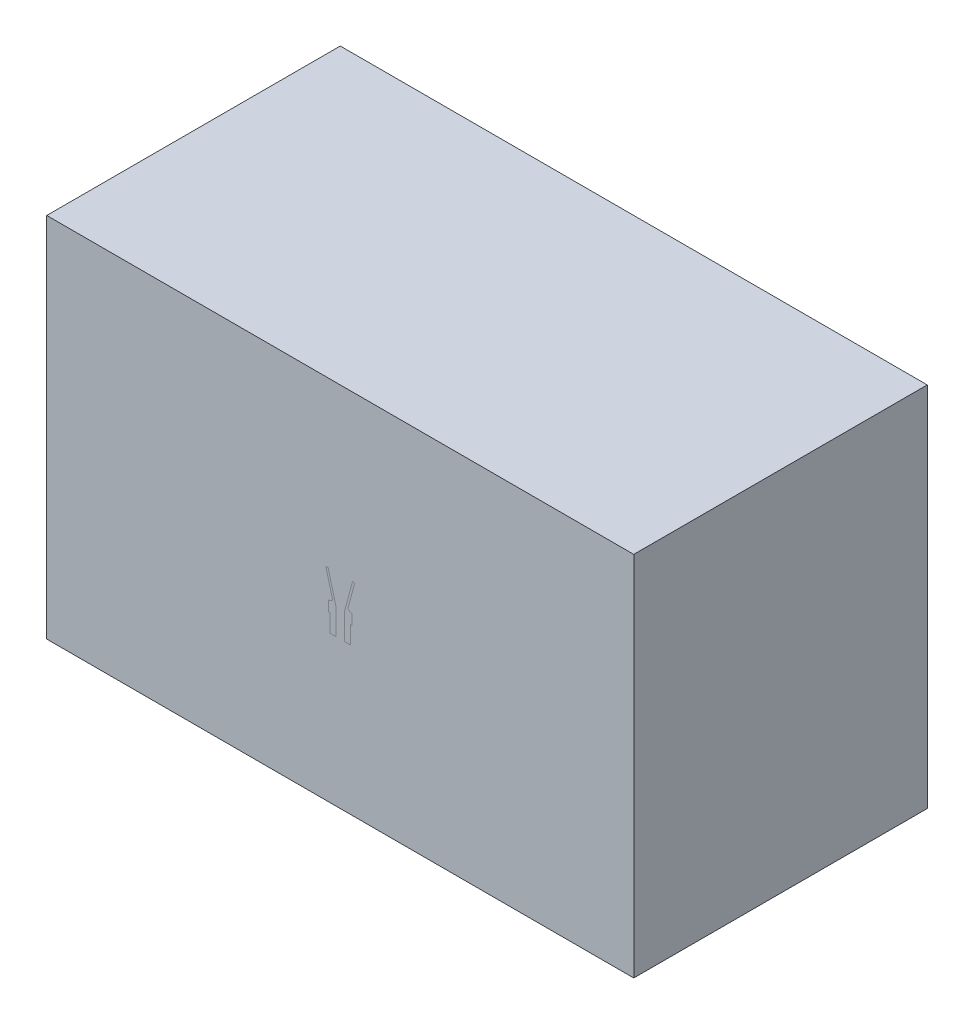
ISO-10303-21;
HEADER;
FILE_DESCRIPTION(('STEP AP214'),'2;1');
FILE_NAME('part.step','',(''),(''),'','','');
FILE_SCHEMA(('AUTOMOTIVE_DESIGN { 1 0 10303 214 1 1 1 1 }'));
ENDSEC;
DATA;
#1=APPLICATION_CONTEXT('core data for automotive mechanical design processes');
#2=APPLICATION_PROTOCOL_DEFINITION('international standard','automotive_design',2000,#1);
#3=PRODUCT_CONTEXT('',#1,'mechanical');
#4=PRODUCT('Part','Part','',(#3));
#5=PRODUCT_RELATED_PRODUCT_CATEGORY('part','',(#4));
#6=PRODUCT_DEFINITION_FORMATION('','',#4);
#7=PRODUCT_DEFINITION_CONTEXT('part definition',#1,'design');
#8=PRODUCT_DEFINITION('design','',#6,#7);
#9=PRODUCT_DEFINITION_SHAPE('','',#8);
#10=(LENGTH_UNIT() NAMED_UNIT(*) SI_UNIT(.MILLI.,.METRE.));
#11=(NAMED_UNIT(*) PLANE_ANGLE_UNIT() SI_UNIT($,.RADIAN.));
#12=(NAMED_UNIT(*) SI_UNIT($,.STERADIAN.) SOLID_ANGLE_UNIT());
#13=UNCERTAINTY_MEASURE_WITH_UNIT(LENGTH_MEASURE(1.E-05),#10,'distance_accuracy_value','');
#14=(GEOMETRIC_REPRESENTATION_CONTEXT(3) GLOBAL_UNCERTAINTY_ASSIGNED_CONTEXT((#13)) GLOBAL_UNIT_ASSIGNED_CONTEXT((#10,
#11,#12)) REPRESENTATION_CONTEXT('',''));
#15=CARTESIAN_POINT('',(0.,0.,0.));
#16=DIRECTION('',(0.,0.,1.));
#17=DIRECTION('',(1.,0.,0.));
#18=AXIS2_PLACEMENT_3D('',#15,#16,#17);
#19=CARTESIAN_POINT('',(0.,457.,0.));
#20=DIRECTION('',(0.,1.,0.));
#21=DIRECTION('',(0.,0.,1.));
#22=AXIS2_PLACEMENT_3D('',#19,#20,#21);
#23=CONICAL_SURFACE('',#22,75.,0.261799387799143);
#24=DIRECTION('',(0.258819045102515,0.96592582628907,0.));
#25=VECTOR('',#24,1.);
#26=CARTESIAN_POINT('',(0.,177.096189432327,0.));
#27=LINE('',#26,#25);
#28=CARTESIAN_POINT('',(213.054078657681,972.22483574259,0.));
#29=VERTEX_POINT('',#28);
#30=CARTESIAN_POINT('',(75.,457.,0.));
#31=VERTEX_POINT('',#30);
#32=EDGE_CURVE('E171',#29,#31,#27,.F.);
#33=ORIENTED_EDGE('',*,*,#32,.F.);
#34=CARTESIAN_POINT('',(0.,972.22483574259,0.));
#35=DIRECTION('',(0.,-1.,0.));
#36=DIRECTION('',(0.,0.,-1.));
#37=AXIS2_PLACEMENT_3D('',#34,#35,#36);
#38=CIRCLE('',#37,213.054078657681);
#39=CARTESIAN_POINT('',(-213.054078657681,972.22483574259,0.));
#40=VERTEX_POINT('',#39);
#41=EDGE_CURVE('E155',#40,#29,#38,.T.);
#42=ORIENTED_EDGE('',*,*,#41,.F.);
#43=DIRECTION('',(0.258819045102515,-0.96592582628907,0.));
#44=VECTOR('',#43,1.);
#45=CARTESIAN_POINT('',(0.,177.096189432327,0.));
#46=LINE('',#45,#44);
#47=CARTESIAN_POINT('',(-75.,457.,0.));
#48=VERTEX_POINT('',#47);
#49=EDGE_CURVE('E136',#48,#40,#46,.F.);
#50=ORIENTED_EDGE('',*,*,#49,.F.);
#51=CARTESIAN_POINT('',(0.,457.,0.));
#52=DIRECTION('',(0.,-1.,0.));
#53=DIRECTION('',(0.,0.,-1.));
#54=AXIS2_PLACEMENT_3D('',#51,#52,#53);
#55=CIRCLE('',#54,75.);
#56=EDGE_CURVE('E124',#48,#31,#55,.T.);
#57=ORIENTED_EDGE('',*,*,#56,.T.);
#58=EDGE_LOOP('',(#33,#42,#50,#57));
#59=FACE_BOUND('',#58,.T.);
#60=ADVANCED_FACE('F49',(#59),#23,.F.);
#61=CARTESIAN_POINT('',(0.,972.22483574259,0.));
#62=DIRECTION('',(0.,-1.,0.));
#63=DIRECTION('',(0.,0.,-1.));
#64=AXIS2_PLACEMENT_3D('',#61,#62,#63);
#65=CONICAL_SURFACE('',#64,213.054078657681,1.30899693899576);
#66=DIRECTION('',(-0.96592582628907,-0.258819045102513,0.));
#67=VECTOR('',#66,1.);
#68=CARTESIAN_POINT('',(0.,1029.31250406307,0.));
#69=LINE('',#68,#67);
#70=CARTESIAN_POINT('',(-249.855852639295,962.363830124184,0.));
#71=VERTEX_POINT('',#70);
#72=EDGE_CURVE('E140',#40,#71,#69,.T.);
#73=ORIENTED_EDGE('',*,*,#72,.F.);
#74=ORIENTED_EDGE('',*,*,#41,.T.);
#75=DIRECTION('',(-0.96592582628907,0.258819045102513,0.));
#76=VECTOR('',#75,1.);
#77=CARTESIAN_POINT('',(0.,1029.31250406307,0.));
#78=LINE('',#77,#76);
#79=CARTESIAN_POINT('',(249.855852639295,962.363830124184,0.));
#80=VERTEX_POINT('',#79);
#81=EDGE_CURVE('E173',#80,#29,#78,.T.);
#82=ORIENTED_EDGE('',*,*,#81,.F.);
#83=CARTESIAN_POINT('',(0.,962.363830124184,0.));
#84=DIRECTION('',(0.,-1.,0.));
#85=DIRECTION('',(0.,0.,-1.));
#86=AXIS2_PLACEMENT_3D('',#83,#84,#85);
#87=CIRCLE('',#86,249.855852639295);
#88=EDGE_CURVE('E152',#71,#80,#87,.T.);
#89=ORIENTED_EDGE('',*,*,#88,.F.);
#90=EDGE_LOOP('',(#73,#74,#82,#89));
#91=FACE_BOUND('',#90,.T.);
#92=ADVANCED_FACE('F199',(#91),#65,.T.);
#93=CARTESIAN_POINT('',(0.,962.363830124184,0.));
#94=DIRECTION('',(0.,1.,0.));
#95=DIRECTION('',(0.,0.,1.));
#96=AXIS2_PLACEMENT_3D('',#93,#94,#95);
#97=CONICAL_SURFACE('',#96,249.855852639295,0.261799387799143);
#98=DIRECTION('',(0.258819045102515,0.96592582628907,0.));
#99=VECTOR('',#98,1.);
#100=CARTESIAN_POINT('',(0.,29.8890935058702,0.));
#101=LINE('',#100,#99);
#102=CARTESIAN_POINT('',(130.041054294359,515.208915202252,0.));
#103=VERTEX_POINT('',#102);
#104=EDGE_CURVE('E175',#103,#80,#101,.T.);
#105=ORIENTED_EDGE('',*,*,#104,.F.);
#106=CARTESIAN_POINT('',(0.,515.208915202252,0.));
#107=DIRECTION('',(0.,-1.,0.));
#108=DIRECTION('',(0.,0.,-1.));
#109=AXIS2_PLACEMENT_3D('',#106,#107,#108);
#110=CIRCLE('',#109,130.041054294359);
#111=CARTESIAN_POINT('',(-130.041054294359,515.208915202252,0.));
#112=VERTEX_POINT('',#111);
#113=EDGE_CURVE('E149',#112,#103,#110,.T.);
#114=ORIENTED_EDGE('',*,*,#113,.F.);
#115=DIRECTION('',(0.258819045102515,-0.96592582628907,0.));
#116=VECTOR('',#115,1.);
#117=CARTESIAN_POINT('',(0.,29.8890935058702,0.));
#118=LINE('',#117,#116);
#119=EDGE_CURVE('E161',#71,#112,#118,.T.);
#120=ORIENTED_EDGE('',*,*,#119,.F.);
#121=ORIENTED_EDGE('',*,*,#88,.T.);
#122=EDGE_LOOP('',(#105,#114,#120,#121));
#123=FACE_BOUND('',#122,.T.);
#124=ADVANCED_FACE('F205',(#123),#97,.T.);
#125=CARTESIAN_POINT('',(0.,515.208915202252,0.));
#126=DIRECTION('',(0.,-1.,0.));
#127=DIRECTION('',(0.,0.,-1.));
#128=AXIS2_PLACEMENT_3D('',#125,#126,#127);
#129=CONICAL_SURFACE('',#128,130.041054294359,1.13446401379632);
#130=DIRECTION('',(-0.906307787036652,-0.422618261740694,0.));
#131=VECTOR('',#130,1.);
#132=CARTESIAN_POINT('',(0.,575.84805469426,0.));
#133=LINE('',#132,#131);
#134=CARTESIAN_POINT('',(-200.4,482.4,0.));
#135=VERTEX_POINT('',#134);
#136=EDGE_CURVE('E163',#112,#135,#133,.T.);
#137=ORIENTED_EDGE('',*,*,#136,.F.);
#138=ORIENTED_EDGE('',*,*,#113,.T.);
#139=DIRECTION('',(-0.906307787036652,0.422618261740694,0.));
#140=VECTOR('',#139,1.);
#141=CARTESIAN_POINT('',(0.,575.84805469426,0.));
#142=LINE('',#141,#140);
#143=CARTESIAN_POINT('',(200.4,482.4,0.));
#144=VERTEX_POINT('',#143);
#145=EDGE_CURVE('E177',#144,#103,#142,.T.);
#146=ORIENTED_EDGE('',*,*,#145,.F.);
#147=CARTESIAN_POINT('',(0.,482.4,0.));
#148=DIRECTION('',(0.,-1.,0.));
#149=DIRECTION('',(0.,0.,-1.));
#150=AXIS2_PLACEMENT_3D('',#147,#148,#149);
#151=CIRCLE('',#150,200.4);
#152=EDGE_CURVE('E146',#135,#144,#151,.T.);
#153=ORIENTED_EDGE('',*,*,#152,.F.);
#154=EDGE_LOOP('',(#137,#138,#146,#153));
#155=FACE_BOUND('',#154,.T.);
#156=ADVANCED_FACE('F213',(#155),#129,.T.);
#157=CARTESIAN_POINT('',(0.,0.,0.));
#158=DIRECTION('',(0.,-1.,0.));
#159=DIRECTION('',(0.,0.,-1.));
#160=AXIS2_PLACEMENT_3D('',#157,#158,#159);
#161=CYLINDRICAL_SURFACE('',#160,200.4);
#162=DIRECTION('',(0.,-1.,0.));
#163=VECTOR('',#162,1.);
#164=CARTESIAN_POINT('',(-200.4,0.,0.));
#165=LINE('',#164,#163);
#166=CARTESIAN_POINT('',(-200.4,307.,0.));
#167=VERTEX_POINT('',#166);
#168=EDGE_CURVE('E165',#135,#167,#165,.T.);
#169=ORIENTED_EDGE('',*,*,#168,.F.);
#170=ORIENTED_EDGE('',*,*,#152,.T.);
#171=DIRECTION('',(0.,-1.,0.));
#172=VECTOR('',#171,1.);
#173=CARTESIAN_POINT('',(200.4,0.,0.));
#174=LINE('',#173,#172);
#175=CARTESIAN_POINT('',(200.4,307.,0.));
#176=VERTEX_POINT('',#175);
#177=EDGE_CURVE('E131',#176,#144,#174,.F.);
#178=ORIENTED_EDGE('',*,*,#177,.F.);
#179=CARTESIAN_POINT('',(0.,307.,0.));
#180=DIRECTION('',(0.,-1.,0.));
#181=DIRECTION('',(0.,0.,-1.));
#182=AXIS2_PLACEMENT_3D('',#179,#180,#181);
#183=CIRCLE('',#182,200.4);
#184=EDGE_CURVE('E130',#167,#176,#183,.T.);
#185=ORIENTED_EDGE('',*,*,#184,.F.);
#186=EDGE_LOOP('',(#169,#170,#178,#185));
#187=FACE_BOUND('',#186,.T.);
#188=ADVANCED_FACE('F217',(#187),#161,.T.);
#189=CARTESIAN_POINT('',(-175.,307.,0.));
#190=DIRECTION('',(0.,1.,0.));
#191=DIRECTION('',(0.,0.,1.));
#192=AXIS2_PLACEMENT_3D('',#189,#190,#191);
#193=PLANE('',#192);
#194=DIRECTION('',(1.,0.,0.));
#195=VECTOR('',#194,1.);
#196=CARTESIAN_POINT('',(-175.,307.,0.));
#197=LINE('',#196,#195);
#198=CARTESIAN_POINT('',(-175.,307.,0.));
#199=VERTEX_POINT('',#198);
#200=EDGE_CURVE('E71',#167,#199,#197,.T.);
#201=ORIENTED_EDGE('',*,*,#200,.F.);
#202=ORIENTED_EDGE('',*,*,#184,.T.);
#203=CARTESIAN_POINT('',(175.,307.,0.));
#204=VERTEX_POINT('',#203);
#205=EDGE_CURVE('E118',#204,#176,#197,.T.);
#206=ORIENTED_EDGE('',*,*,#205,.F.);
#207=CARTESIAN_POINT('',(0.,307.,0.));
#208=DIRECTION('',(0.,1.,0.));
#209=DIRECTION('',(0.,0.,1.));
#210=AXIS2_PLACEMENT_3D('',#207,#208,#209);
#211=CIRCLE('',#210,175.);
#212=EDGE_CURVE('E128',#204,#199,#211,.T.);
#213=ORIENTED_EDGE('',*,*,#212,.T.);
#214=EDGE_LOOP('',(#201,#202,#206,#213));
#215=FACE_BOUND('',#214,.T.);
#216=ADVANCED_FACE('F51',(#215),#193,.F.);
#217=CARTESIAN_POINT('',(0.,457.,0.));
#218=DIRECTION('',(0.,-1.,0.));
#219=DIRECTION('',(0.,0.,-1.));
#220=AXIS2_PLACEMENT_3D('',#217,#218,#219);
#221=CYLINDRICAL_SURFACE('',#220,75.);
#222=ORIENTED_EDGE('',*,*,#56,.F.);
#223=DIRECTION('',(0.,-1.,0.));
#224=VECTOR('',#223,1.);
#225=CARTESIAN_POINT('',(-75.,457.,0.));
#226=LINE('',#225,#224);
#227=CARTESIAN_POINT('',(-75.,0.,0.));
#228=VERTEX_POINT('',#227);
#229=EDGE_CURVE('E167',#48,#228,#226,.T.);
#230=ORIENTED_EDGE('',*,*,#229,.T.);
#231=CARTESIAN_POINT('',(0.,0.,0.));
#232=DIRECTION('',(0.,1.,0.));
#233=DIRECTION('',(0.,0.,1.));
#234=AXIS2_PLACEMENT_3D('',#231,#232,#233);
#235=CIRCLE('',#234,75.);
#236=CARTESIAN_POINT('',(75.,0.,0.));
#237=VERTEX_POINT('',#236);
#238=EDGE_CURVE('E138',#237,#228,#235,.T.);
#239=ORIENTED_EDGE('',*,*,#238,.F.);
#240=DIRECTION('',(0.,-1.,0.));
#241=VECTOR('',#240,1.);
#242=CARTESIAN_POINT('',(75.,457.,0.));
#243=LINE('',#242,#241);
#244=EDGE_CURVE('E132',#237,#31,#243,.F.);
#245=ORIENTED_EDGE('',*,*,#244,.T.);
#246=EDGE_LOOP('',(#222,#230,#239,#245));
#247=FACE_BOUND('',#246,.T.);
#248=ADVANCED_FACE('F189',(#247),#221,.F.);
#249=CARTESIAN_POINT('',(0.,0.,0.));
#250=DIRECTION('',(0.,1.,0.));
#251=DIRECTION('',(0.,0.,1.));
#252=AXIS2_PLACEMENT_3D('',#249,#250,#251);
#253=PLANE('',#252);
#254=DIRECTION('',(1.,0.,0.));
#255=VECTOR('',#254,1.);
#256=CARTESIAN_POINT('',(0.,0.,0.));
#257=LINE('',#256,#255);
#258=CARTESIAN_POINT('',(-175.,0.,0.));
#259=VERTEX_POINT('',#258);
#260=EDGE_CURVE('E170',#259,#228,#257,.T.);
#261=ORIENTED_EDGE('',*,*,#260,.F.);
#262=CARTESIAN_POINT('',(0.,0.,0.));
#263=DIRECTION('',(0.,1.,0.));
#264=DIRECTION('',(0.,0.,1.));
#265=AXIS2_PLACEMENT_3D('',#262,#263,#264);
#266=CIRCLE('',#265,175.);
#267=CARTESIAN_POINT('',(175.,0.,0.));
#268=VERTEX_POINT('',#267);
#269=EDGE_CURVE('E135',#268,#259,#266,.T.);
#270=ORIENTED_EDGE('',*,*,#269,.F.);
#271=EDGE_CURVE('E64',#237,#268,#257,.T.);
#272=ORIENTED_EDGE('',*,*,#271,.F.);
#273=ORIENTED_EDGE('',*,*,#238,.T.);
#274=EDGE_LOOP('',(#261,#270,#272,#273));
#275=FACE_BOUND('',#274,.T.);
#276=ADVANCED_FACE('F190',(#275),#253,.F.);
#277=CARTESIAN_POINT('',(0.,457.,0.));
#278=DIRECTION('',(0.,-1.,0.));
#279=DIRECTION('',(0.,0.,-1.));
#280=AXIS2_PLACEMENT_3D('',#277,#278,#279);
#281=CYLINDRICAL_SURFACE('',#280,175.);
#282=DIRECTION('',(0.,-1.,0.));
#283=VECTOR('',#282,1.);
#284=CARTESIAN_POINT('',(-175.,457.,0.));
#285=LINE('',#284,#283);
#286=EDGE_CURVE('E12',#199,#259,#285,.T.);
#287=ORIENTED_EDGE('',*,*,#286,.F.);
#288=ORIENTED_EDGE('',*,*,#212,.F.);
#289=DIRECTION('',(0.,-1.,0.));
#290=VECTOR('',#289,1.);
#291=CARTESIAN_POINT('',(175.,457.,0.));
#292=LINE('',#291,#290);
#293=EDGE_CURVE('E57',#268,#204,#292,.F.);
#294=ORIENTED_EDGE('',*,*,#293,.F.);
#295=ORIENTED_EDGE('',*,*,#269,.T.);
#296=EDGE_LOOP('',(#287,#288,#294,#295));
#297=FACE_BOUND('',#296,.T.);
#298=ADVANCED_FACE('F134',(#297),#281,.T.);
#299=CARTESIAN_POINT('',(0.,0.,0.));
#300=DIRECTION('',(0.,0.,1.));
#301=DIRECTION('',(1.,0.,0.));
#302=AXIS2_PLACEMENT_3D('',#299,#300,#301);
#303=PLANE('',#302);
#304=ORIENTED_EDGE('',*,*,#32,.T.);
#305=ORIENTED_EDGE('',*,*,#244,.F.);
#306=ORIENTED_EDGE('',*,*,#271,.T.);
#307=ORIENTED_EDGE('',*,*,#293,.T.);
#308=ORIENTED_EDGE('',*,*,#205,.T.);
#309=ORIENTED_EDGE('',*,*,#177,.T.);
#310=ORIENTED_EDGE('',*,*,#145,.T.);
#311=ORIENTED_EDGE('',*,*,#104,.T.);
#312=ORIENTED_EDGE('',*,*,#81,.T.);
#313=EDGE_LOOP('',(#304,#305,#306,#307,#308,#309,#310,#311,#312));
#314=FACE_BOUND('',#313,.T.);
#315=ADVANCED_FACE('F117',(#314),#303,.T.);
#316=ORIENTED_EDGE('',*,*,#49,.T.);
#317=ORIENTED_EDGE('',*,*,#72,.T.);
#318=ORIENTED_EDGE('',*,*,#119,.T.);
#319=ORIENTED_EDGE('',*,*,#136,.T.);
#320=ORIENTED_EDGE('',*,*,#168,.T.);
#321=ORIENTED_EDGE('',*,*,#200,.T.);
#322=ORIENTED_EDGE('',*,*,#286,.T.);
#323=ORIENTED_EDGE('',*,*,#260,.T.);
#324=ORIENTED_EDGE('',*,*,#229,.F.);
#325=EDGE_LOOP('',(#316,#317,#318,#319,#320,#321,#322,#323,#324));
#326=FACE_BOUND('',#325,.T.);
#327=ADVANCED_FACE('F183',(#326),#303,.T.);
#328=CLOSED_SHELL('',(#60,#92,#124,#156,#188,#216,#248,#276,#298,#315,#327));
#329=MANIFOLD_SOLID_BREP('B2',#328);
#330=CARTESIAN_POINT('',(5080.,-2540.,5080.));
#331=DIRECTION('',(0.,1.,0.));
#332=DIRECTION('',(0.,0.,1.));
#333=AXIS2_PLACEMENT_3D('',#330,#331,#332);
#334=PLANE('',#333);
#335=DIRECTION('',(1.,0.,0.));
#336=VECTOR('',#335,1.);
#337=CARTESIAN_POINT('',(5080.,-2540.,0.));
#338=LINE('',#337,#336);
#339=CARTESIAN_POINT('',(-5080.,-2540.,0.));
#340=VERTEX_POINT('',#339);
#341=CARTESIAN_POINT('',(5080.,-2540.,0.));
#342=VERTEX_POINT('',#341);
#343=EDGE_CURVE('E481',#340,#342,#338,.T.);
#344=ORIENTED_EDGE('',*,*,#343,.F.);
#345=DIRECTION('',(0.,0.,-1.));
#346=VECTOR('',#345,1.);
#347=CARTESIAN_POINT('',(-5080.,-2540.,5080.));
#348=LINE('',#347,#346);
#349=CARTESIAN_POINT('',(-5080.,-2540.,-5080.));
#350=VERTEX_POINT('',#349);
#351=EDGE_CURVE('E466',#340,#350,#348,.T.);
#352=ORIENTED_EDGE('',*,*,#351,.T.);
#353=DIRECTION('',(-1.,0.,0.));
#354=VECTOR('',#353,1.);
#355=CARTESIAN_POINT('',(5080.,-2540.,-5080.));
#356=LINE('',#355,#354);
#357=CARTESIAN_POINT('',(5080.,-2540.,-5080.));
#358=VERTEX_POINT('',#357);
#359=EDGE_CURVE('E425',#358,#350,#356,.T.);
#360=ORIENTED_EDGE('',*,*,#359,.F.);
#361=DIRECTION('',(0.,0.,-1.));
#362=VECTOR('',#361,1.);
#363=CARTESIAN_POINT('',(5080.,-2540.,5080.));
#364=LINE('',#363,#362);
#365=EDGE_CURVE('E462',#342,#358,#364,.T.);
#366=ORIENTED_EDGE('',*,*,#365,.F.);
#367=EDGE_LOOP('',(#344,#352,#360,#366));
#368=FACE_BOUND('',#367,.T.);
#369=ADVANCED_FACE('F303',(#368),#334,.F.);
#370=CARTESIAN_POINT('',(5080.,3810.00000000001,5080.));
#371=DIRECTION('',(0.,-1.,0.));
#372=DIRECTION('',(0.,0.,-1.));
#373=AXIS2_PLACEMENT_3D('',#370,#371,#372);
#374=PLANE('',#373);
#375=DIRECTION('',(-1.,0.,0.));
#376=VECTOR('',#375,1.);
#377=CARTESIAN_POINT('',(5080.,3810.,0.));
#378=LINE('',#377,#376);
#379=CARTESIAN_POINT('',(5080.,3810.,0.));
#380=VERTEX_POINT('',#379);
#381=CARTESIAN_POINT('',(-5080.,3810.,1.77635683940025E-12));
#382=VERTEX_POINT('',#381);
#383=EDGE_CURVE('E319',#380,#382,#378,.T.);
#384=ORIENTED_EDGE('',*,*,#383,.F.);
#385=DIRECTION('',(0.,0.,1.));
#386=VECTOR('',#385,1.);
#387=CARTESIAN_POINT('',(5080.,3810.00000000001,5080.));
#388=LINE('',#387,#386);
#389=CARTESIAN_POINT('',(5080.,3810.,-5080.));
#390=VERTEX_POINT('',#389);
#391=EDGE_CURVE('E457',#390,#380,#388,.T.);
#392=ORIENTED_EDGE('',*,*,#391,.F.);
#393=DIRECTION('',(-1.,0.,0.));
#394=VECTOR('',#393,1.);
#395=CARTESIAN_POINT('',(5080.,3810.,-5080.));
#396=LINE('',#395,#394);
#397=CARTESIAN_POINT('',(-5080.,3810.,-5080.));
#398=VERTEX_POINT('',#397);
#399=EDGE_CURVE('E453',#390,#398,#396,.T.);
#400=ORIENTED_EDGE('',*,*,#399,.T.);
#401=DIRECTION('',(0.,0.,1.));
#402=VECTOR('',#401,1.);
#403=CARTESIAN_POINT('',(-5080.,3810.00000000001,5080.));
#404=LINE('',#403,#402);
#405=EDGE_CURVE('E458',#398,#382,#404,.T.);
#406=ORIENTED_EDGE('',*,*,#405,.T.);
#407=EDGE_LOOP('',(#384,#392,#400,#406));
#408=FACE_BOUND('',#407,.T.);
#409=ADVANCED_FACE('F570',(#408),#374,.F.);
#410=CARTESIAN_POINT('',(5080.,0.,0.));
#411=DIRECTION('',(1.,0.,0.));
#412=DIRECTION('',(0.,0.,-1.));
#413=AXIS2_PLACEMENT_3D('',#410,#411,#412);
#414=PLANE('',#413);
#415=ORIENTED_EDGE('',*,*,#391,.T.);
#416=DIRECTION('',(0.,-1.,0.));
#417=VECTOR('',#416,1.);
#418=CARTESIAN_POINT('',(5080.,0.,0.));
#419=LINE('',#418,#417);
#420=EDGE_CURVE('E469',#380,#342,#419,.T.);
#421=ORIENTED_EDGE('',*,*,#420,.T.);
#422=ORIENTED_EDGE('',*,*,#365,.T.);
#423=DIRECTION('',(0.,1.,0.));
#424=VECTOR('',#423,1.);
#425=CARTESIAN_POINT('',(5080.,3810.,-5080.));
#426=LINE('',#425,#424);
#427=EDGE_CURVE('E473',#358,#390,#426,.T.);
#428=ORIENTED_EDGE('',*,*,#427,.T.);
#429=EDGE_LOOP('',(#415,#421,#422,#428));
#430=FACE_BOUND('',#429,.T.);
#431=ADVANCED_FACE('F576',(#430),#414,.T.);
#432=CARTESIAN_POINT('',(-5080.,0.,0.));
#433=DIRECTION('',(1.,0.,0.));
#434=DIRECTION('',(0.,0.,-1.));
#435=AXIS2_PLACEMENT_3D('',#432,#433,#434);
#436=PLANE('',#435);
#437=DIRECTION('',(0.,-1.,0.));
#438=VECTOR('',#437,1.);
#439=CARTESIAN_POINT('',(-5080.,0.,0.));
#440=LINE('',#439,#438);
#441=EDGE_CURVE('E486',#382,#340,#440,.T.);
#442=ORIENTED_EDGE('',*,*,#441,.F.);
#443=ORIENTED_EDGE('',*,*,#405,.F.);
#444=DIRECTION('',(0.,1.,0.));
#445=VECTOR('',#444,1.);
#446=CARTESIAN_POINT('',(-5080.,3810.,-5080.));
#447=LINE('',#446,#445);
#448=EDGE_CURVE('E463',#350,#398,#447,.T.);
#449=ORIENTED_EDGE('',*,*,#448,.F.);
#450=ORIENTED_EDGE('',*,*,#351,.F.);
#451=EDGE_LOOP('',(#442,#443,#449,#450));
#452=FACE_BOUND('',#451,.T.);
#453=ADVANCED_FACE('F583',(#452),#436,.F.);
#454=CARTESIAN_POINT('',(5080.,3810.,-5080.));
#455=DIRECTION('',(0.,0.,1.));
#456=DIRECTION('',(0.,-1.,0.));
#457=AXIS2_PLACEMENT_3D('',#454,#455,#456);
#458=PLANE('',#457);
#459=ORIENTED_EDGE('',*,*,#448,.T.);
#460=ORIENTED_EDGE('',*,*,#399,.F.);
#461=ORIENTED_EDGE('',*,*,#427,.F.);
#462=ORIENTED_EDGE('',*,*,#359,.T.);
#463=EDGE_LOOP('',(#459,#460,#461,#462));
#464=FACE_BOUND('',#463,.T.);
#465=ADVANCED_FACE('F581',(#464),#458,.F.);
#466=CARTESIAN_POINT('',(0.,0.,0.));
#467=DIRECTION('',(0.,0.,1.));
#468=DIRECTION('',(1.,0.,0.));
#469=AXIS2_PLACEMENT_3D('',#466,#467,#468);
#470=PLANE('',#469);
#471=ORIENTED_EDGE('',*,*,#383,.T.);
#472=ORIENTED_EDGE('',*,*,#441,.T.);
#473=ORIENTED_EDGE('',*,*,#343,.T.);
#474=ORIENTED_EDGE('',*,*,#420,.F.);
#475=EDGE_LOOP('',(#471,#472,#473,#474));
#476=FACE_BOUND('',#475,.T.);
#477=DIRECTION('',(0.,-1.,0.));
#478=VECTOR('',#477,1.);
#479=CARTESIAN_POINT('',(-75.,457.,0.));
#480=LINE('',#479,#478);
#481=CARTESIAN_POINT('',(-75.,457.,0.));
#482=VERTEX_POINT('',#481);
#483=CARTESIAN_POINT('',(-75.,0.,0.));
#484=VERTEX_POINT('',#483);
#485=EDGE_CURVE('E510',#482,#484,#480,.T.);
#486=ORIENTED_EDGE('',*,*,#485,.T.);
#487=DIRECTION('',(1.,0.,0.));
#488=VECTOR('',#487,1.);
#489=CARTESIAN_POINT('',(0.,0.,0.));
#490=LINE('',#489,#488);
#491=CARTESIAN_POINT('',(-175.,0.,0.));
#492=VERTEX_POINT('',#491);
#493=EDGE_CURVE('E417',#492,#484,#490,.T.);
#494=ORIENTED_EDGE('',*,*,#493,.F.);
#495=DIRECTION('',(0.,-1.,0.));
#496=VECTOR('',#495,1.);
#497=CARTESIAN_POINT('',(-175.,457.,0.));
#498=LINE('',#497,#496);
#499=CARTESIAN_POINT('',(-175.,307.,0.));
#500=VERTEX_POINT('',#499);
#501=EDGE_CURVE('E47',#500,#492,#498,.T.);
#502=ORIENTED_EDGE('',*,*,#501,.F.);
#503=DIRECTION('',(1.,0.,0.));
#504=VECTOR('',#503,1.);
#505=CARTESIAN_POINT('',(-175.,307.,0.));
#506=LINE('',#505,#504);
#507=CARTESIAN_POINT('',(-200.4,307.,0.));
#508=VERTEX_POINT('',#507);
#509=EDGE_CURVE('E509',#508,#500,#506,.T.);
#510=ORIENTED_EDGE('',*,*,#509,.F.);
#511=DIRECTION('',(0.,-1.,0.));
#512=VECTOR('',#511,1.);
#513=CARTESIAN_POINT('',(-200.4,0.,0.));
#514=LINE('',#513,#512);
#515=CARTESIAN_POINT('',(-200.4,482.4,0.));
#516=VERTEX_POINT('',#515);
#517=EDGE_CURVE('E505',#516,#508,#514,.T.);
#518=ORIENTED_EDGE('',*,*,#517,.F.);
#519=DIRECTION('',(-0.906307787036652,-0.422618261740694,0.));
#520=VECTOR('',#519,1.);
#521=CARTESIAN_POINT('',(0.,575.84805469426,0.));
#522=LINE('',#521,#520);
#523=CARTESIAN_POINT('',(-130.041054294359,515.208915202252,0.));
#524=VERTEX_POINT('',#523);
#525=EDGE_CURVE('E501',#524,#516,#522,.T.);
#526=ORIENTED_EDGE('',*,*,#525,.F.);
#527=DIRECTION('',(0.258819045102515,-0.96592582628907,0.));
#528=VECTOR('',#527,1.);
#529=CARTESIAN_POINT('',(0.,29.8890935058702,0.));
#530=LINE('',#529,#528);
#531=CARTESIAN_POINT('',(-249.855852639295,962.363830124184,0.));
#532=VERTEX_POINT('',#531);
#533=EDGE_CURVE('E497',#532,#524,#530,.T.);
#534=ORIENTED_EDGE('',*,*,#533,.F.);
#535=DIRECTION('',(-0.96592582628907,-0.258819045102513,0.));
#536=VECTOR('',#535,1.);
#537=CARTESIAN_POINT('',(0.,1029.31250406307,0.));
#538=LINE('',#537,#536);
#539=CARTESIAN_POINT('',(-213.054078657681,972.22483574259,0.));
#540=VERTEX_POINT('',#539);
#541=EDGE_CURVE('E493',#540,#532,#538,.T.);
#542=ORIENTED_EDGE('',*,*,#541,.F.);
#543=DIRECTION('',(0.258819045102515,-0.96592582628907,0.));
#544=VECTOR('',#543,1.);
#545=CARTESIAN_POINT('',(0.,177.096189432327,0.));
#546=LINE('',#545,#544);
#547=EDGE_CURVE('E489',#482,#540,#546,.F.);
#548=ORIENTED_EDGE('',*,*,#547,.F.);
#549=EDGE_LOOP('',(#486,#494,#502,#510,#518,#526,#534,#542,#548));
#550=FACE_BOUND('',#549,.T.);
#551=DIRECTION('',(-0.96592582628907,0.258819045102513,0.));
#552=VECTOR('',#551,1.);
#553=CARTESIAN_POINT('',(0.,1029.31250406307,0.));
#554=LINE('',#553,#552);
#555=CARTESIAN_POINT('',(249.855852639295,962.363830124184,0.));
#556=VERTEX_POINT('',#555);
#557=CARTESIAN_POINT('',(213.054078657681,972.22483574259,0.));
#558=VERTEX_POINT('',#557);
#559=EDGE_CURVE('E517',#556,#558,#554,.T.);
#560=ORIENTED_EDGE('',*,*,#559,.F.);
#561=DIRECTION('',(0.258819045102515,0.96592582628907,0.));
#562=VECTOR('',#561,1.);
#563=CARTESIAN_POINT('',(0.,29.8890935058702,0.));
#564=LINE('',#563,#562);
#565=CARTESIAN_POINT('',(130.041054294359,515.208915202252,0.));
#566=VERTEX_POINT('',#565);
#567=EDGE_CURVE('E521',#566,#556,#564,.T.);
#568=ORIENTED_EDGE('',*,*,#567,.F.);
#569=DIRECTION('',(-0.906307787036652,0.422618261740694,0.));
#570=VECTOR('',#569,1.);
#571=CARTESIAN_POINT('',(0.,575.84805469426,0.));
#572=LINE('',#571,#570);
#573=CARTESIAN_POINT('',(200.4,482.4,0.));
#574=VERTEX_POINT('',#573);
#575=EDGE_CURVE('E525',#574,#566,#572,.T.);
#576=ORIENTED_EDGE('',*,*,#575,.F.);
#577=DIRECTION('',(0.,-1.,0.));
#578=VECTOR('',#577,1.);
#579=CARTESIAN_POINT('',(200.4,0.,0.));
#580=LINE('',#579,#578);
#581=CARTESIAN_POINT('',(200.4,307.,0.));
#582=VERTEX_POINT('',#581);
#583=EDGE_CURVE('E529',#582,#574,#580,.F.);
#584=ORIENTED_EDGE('',*,*,#583,.F.);
#585=CARTESIAN_POINT('',(175.,307.,0.));
#586=VERTEX_POINT('',#585);
#587=EDGE_CURVE('E327',#586,#582,#506,.T.);
#588=ORIENTED_EDGE('',*,*,#587,.F.);
#589=DIRECTION('',(0.,-1.,0.));
#590=VECTOR('',#589,1.);
#591=CARTESIAN_POINT('',(175.,457.,0.));
#592=LINE('',#591,#590);
#593=CARTESIAN_POINT('',(175.,0.,0.));
#594=VERTEX_POINT('',#593);
#595=EDGE_CURVE('E312',#594,#586,#592,.F.);
#596=ORIENTED_EDGE('',*,*,#595,.F.);
#597=CARTESIAN_POINT('',(75.,0.,0.));
#598=VERTEX_POINT('',#597);
#599=EDGE_CURVE('E398',#598,#594,#490,.T.);
#600=ORIENTED_EDGE('',*,*,#599,.F.);
#601=DIRECTION('',(0.,-1.,0.));
#602=VECTOR('',#601,1.);
#603=CARTESIAN_POINT('',(75.,457.,0.));
#604=LINE('',#603,#602);
#605=CARTESIAN_POINT('',(75.,457.,0.));
#606=VERTEX_POINT('',#605);
#607=EDGE_CURVE('E415',#598,#606,#604,.F.);
#608=ORIENTED_EDGE('',*,*,#607,.T.);
#609=DIRECTION('',(0.258819045102515,0.96592582628907,0.));
#610=VECTOR('',#609,1.);
#611=CARTESIAN_POINT('',(0.,177.096189432327,0.));
#612=LINE('',#611,#610);
#613=EDGE_CURVE('E513',#558,#606,#612,.F.);
#614=ORIENTED_EDGE('',*,*,#613,.F.);
#615=EDGE_LOOP('',(#560,#568,#576,#584,#588,#596,#600,#608,#614));
#616=FACE_BOUND('',#615,.T.);
#617=ADVANCED_FACE('F397',(#476,#550,#616),#470,.T.);
#618=CARTESIAN_POINT('',(0.,457.,0.));
#619=DIRECTION('',(0.,1.,0.));
#620=DIRECTION('',(0.,0.,1.));
#621=AXIS2_PLACEMENT_3D('',#618,#619,#620);
#622=CONICAL_SURFACE('',#621,75.,0.261799387799143);
#623=CARTESIAN_POINT('',(0.,972.22483574259,0.));
#624=DIRECTION('',(0.,-1.,0.));
#625=DIRECTION('',(0.,0.,-1.));
#626=AXIS2_PLACEMENT_3D('',#623,#624,#625);
#627=CIRCLE('',#626,213.054078657681);
#628=EDGE_CURVE('E443',#540,#558,#627,.T.);
#629=ORIENTED_EDGE('',*,*,#628,.T.);
#630=ORIENTED_EDGE('',*,*,#613,.T.);
#631=CARTESIAN_POINT('',(0.,457.,0.));
#632=DIRECTION('',(0.,-1.,0.));
#633=DIRECTION('',(0.,0.,-1.));
#634=AXIS2_PLACEMENT_3D('',#631,#632,#633);
#635=CIRCLE('',#634,75.);
#636=EDGE_CURVE('E405',#482,#606,#635,.T.);
#637=ORIENTED_EDGE('',*,*,#636,.F.);
#638=ORIENTED_EDGE('',*,*,#547,.T.);
#639=EDGE_LOOP('',(#629,#630,#637,#638));
#640=FACE_BOUND('',#639,.T.);
#641=ADVANCED_FACE('F539',(#640),#622,.T.);
#642=CARTESIAN_POINT('',(0.,972.22483574259,0.));
#643=DIRECTION('',(0.,-1.,0.));
#644=DIRECTION('',(0.,0.,-1.));
#645=AXIS2_PLACEMENT_3D('',#642,#643,#644);
#646=CONICAL_SURFACE('',#645,213.054078657681,1.30899693899576);
#647=ORIENTED_EDGE('',*,*,#628,.F.);
#648=ORIENTED_EDGE('',*,*,#541,.T.);
#649=CARTESIAN_POINT('',(0.,962.363830124184,0.));
#650=DIRECTION('',(0.,-1.,0.));
#651=DIRECTION('',(0.,0.,-1.));
#652=AXIS2_PLACEMENT_3D('',#649,#650,#651);
#653=CIRCLE('',#652,249.855852639295);
#654=EDGE_CURVE('E439',#532,#556,#653,.T.);
#655=ORIENTED_EDGE('',*,*,#654,.T.);
#656=ORIENTED_EDGE('',*,*,#559,.T.);
#657=EDGE_LOOP('',(#647,#648,#655,#656));
#658=FACE_BOUND('',#657,.T.);
#659=ADVANCED_FACE('F560',(#658),#646,.F.);
#660=CARTESIAN_POINT('',(0.,962.363830124184,0.));
#661=DIRECTION('',(0.,1.,0.));
#662=DIRECTION('',(0.,0.,1.));
#663=AXIS2_PLACEMENT_3D('',#660,#661,#662);
#664=CONICAL_SURFACE('',#663,249.855852639295,0.261799387799143);
#665=CARTESIAN_POINT('',(0.,515.208915202252,0.));
#666=DIRECTION('',(0.,-1.,0.));
#667=DIRECTION('',(0.,0.,-1.));
#668=AXIS2_PLACEMENT_3D('',#665,#666,#667);
#669=CIRCLE('',#668,130.041054294359);
#670=EDGE_CURVE('E435',#524,#566,#669,.T.);
#671=ORIENTED_EDGE('',*,*,#670,.T.);
#672=ORIENTED_EDGE('',*,*,#567,.T.);
#673=ORIENTED_EDGE('',*,*,#654,.F.);
#674=ORIENTED_EDGE('',*,*,#533,.T.);
#675=EDGE_LOOP('',(#671,#672,#673,#674));
#676=FACE_BOUND('',#675,.T.);
#677=ADVANCED_FACE('F558',(#676),#664,.F.);
#678=CARTESIAN_POINT('',(0.,515.208915202252,0.));
#679=DIRECTION('',(0.,-1.,0.));
#680=DIRECTION('',(0.,0.,-1.));
#681=AXIS2_PLACEMENT_3D('',#678,#679,#680);
#682=CONICAL_SURFACE('',#681,130.041054294359,1.13446401379632);
#683=ORIENTED_EDGE('',*,*,#670,.F.);
#684=ORIENTED_EDGE('',*,*,#525,.T.);
#685=CARTESIAN_POINT('',(0.,482.4,0.));
#686=DIRECTION('',(0.,-1.,0.));
#687=DIRECTION('',(0.,0.,-1.));
#688=AXIS2_PLACEMENT_3D('',#685,#686,#687);
#689=CIRCLE('',#688,200.4);
#690=EDGE_CURVE('E431',#516,#574,#689,.T.);
#691=ORIENTED_EDGE('',*,*,#690,.T.);
#692=ORIENTED_EDGE('',*,*,#575,.T.);
#693=EDGE_LOOP('',(#683,#684,#691,#692));
#694=FACE_BOUND('',#693,.T.);
#695=ADVANCED_FACE('F555',(#694),#682,.F.);
#696=CARTESIAN_POINT('',(0.,0.,0.));
#697=DIRECTION('',(0.,-1.,0.));
#698=DIRECTION('',(0.,0.,-1.));
#699=AXIS2_PLACEMENT_3D('',#696,#697,#698);
#700=CYLINDRICAL_SURFACE('',#699,200.4);
#701=ORIENTED_EDGE('',*,*,#690,.F.);
#702=ORIENTED_EDGE('',*,*,#517,.T.);
#703=CARTESIAN_POINT('',(0.,307.,0.));
#704=DIRECTION('',(0.,-1.,0.));
#705=DIRECTION('',(0.,0.,-1.));
#706=AXIS2_PLACEMENT_3D('',#703,#704,#705);
#707=CIRCLE('',#706,200.4);
#708=EDGE_CURVE('E423',#508,#582,#707,.T.);
#709=ORIENTED_EDGE('',*,*,#708,.T.);
#710=ORIENTED_EDGE('',*,*,#583,.T.);
#711=EDGE_LOOP('',(#701,#702,#709,#710));
#712=FACE_BOUND('',#711,.T.);
#713=ADVANCED_FACE('F552',(#712),#700,.F.);
#714=CARTESIAN_POINT('',(-175.,307.,0.));
#715=DIRECTION('',(0.,1.,0.));
#716=DIRECTION('',(0.,0.,1.));
#717=AXIS2_PLACEMENT_3D('',#714,#715,#716);
#718=PLANE('',#717);
#719=ORIENTED_EDGE('',*,*,#708,.F.);
#720=ORIENTED_EDGE('',*,*,#509,.T.);
#721=CARTESIAN_POINT('',(0.,307.,0.));
#722=DIRECTION('',(0.,1.,0.));
#723=DIRECTION('',(0.,0.,1.));
#724=AXIS2_PLACEMENT_3D('',#721,#722,#723);
#725=CIRCLE('',#724,175.);
#726=EDGE_CURVE('E419',#586,#500,#725,.T.);
#727=ORIENTED_EDGE('',*,*,#726,.F.);
#728=ORIENTED_EDGE('',*,*,#587,.T.);
#729=EDGE_LOOP('',(#719,#720,#727,#728));
#730=FACE_BOUND('',#729,.T.);
#731=ADVANCED_FACE('F549',(#730),#718,.T.);
#732=CARTESIAN_POINT('',(0.,457.,0.));
#733=DIRECTION('',(0.,-1.,0.));
#734=DIRECTION('',(0.,0.,-1.));
#735=AXIS2_PLACEMENT_3D('',#732,#733,#734);
#736=CYLINDRICAL_SURFACE('',#735,75.);
#737=ORIENTED_EDGE('',*,*,#485,.F.);
#738=ORIENTED_EDGE('',*,*,#636,.T.);
#739=ORIENTED_EDGE('',*,*,#607,.F.);
#740=CARTESIAN_POINT('',(0.,0.,0.));
#741=DIRECTION('',(0.,1.,0.));
#742=DIRECTION('',(0.,0.,1.));
#743=AXIS2_PLACEMENT_3D('',#740,#741,#742);
#744=CIRCLE('',#743,75.);
#745=EDGE_CURVE('E413',#598,#484,#744,.T.);
#746=ORIENTED_EDGE('',*,*,#745,.T.);
#747=EDGE_LOOP('',(#737,#738,#739,#746));
#748=FACE_BOUND('',#747,.T.);
#749=ADVANCED_FACE('F542',(#748),#736,.T.);
#750=CARTESIAN_POINT('',(0.,0.,0.));
#751=DIRECTION('',(0.,1.,0.));
#752=DIRECTION('',(0.,0.,1.));
#753=AXIS2_PLACEMENT_3D('',#750,#751,#752);
#754=PLANE('',#753);
#755=CARTESIAN_POINT('',(0.,0.,0.));
#756=DIRECTION('',(0.,1.,0.));
#757=DIRECTION('',(0.,0.,1.));
#758=AXIS2_PLACEMENT_3D('',#755,#756,#757);
#759=CIRCLE('',#758,175.);
#760=EDGE_CURVE('E411',#594,#492,#759,.T.);
#761=ORIENTED_EDGE('',*,*,#760,.T.);
#762=ORIENTED_EDGE('',*,*,#493,.T.);
#763=ORIENTED_EDGE('',*,*,#745,.F.);
#764=ORIENTED_EDGE('',*,*,#599,.T.);
#765=EDGE_LOOP('',(#761,#762,#763,#764));
#766=FACE_BOUND('',#765,.T.);
#767=ADVANCED_FACE('F409',(#766),#754,.T.);
#768=CARTESIAN_POINT('',(0.,457.,0.));
#769=DIRECTION('',(0.,-1.,0.));
#770=DIRECTION('',(0.,0.,-1.));
#771=AXIS2_PLACEMENT_3D('',#768,#769,#770);
#772=CYLINDRICAL_SURFACE('',#771,175.);
#773=ORIENTED_EDGE('',*,*,#726,.T.);
#774=ORIENTED_EDGE('',*,*,#501,.T.);
#775=ORIENTED_EDGE('',*,*,#760,.F.);
#776=ORIENTED_EDGE('',*,*,#595,.T.);
#777=EDGE_LOOP('',(#773,#774,#775,#776));
#778=FACE_BOUND('',#777,.T.);
#779=ADVANCED_FACE('F305',(#778),#772,.F.);
#780=CLOSED_SHELL('',(#369,#409,#431,#453,#465,#617,#641,#659,#677,#695,#713,#731,#749,#767,#779));
#781=MANIFOLD_SOLID_BREP('B6',#780);
#782=ADVANCED_BREP_SHAPE_REPRESENTATION('',(#18,#329,#781),#14);
#783=SHAPE_DEFINITION_REPRESENTATION(#9,#782);
ENDSEC;
END-ISO-10303-21;
